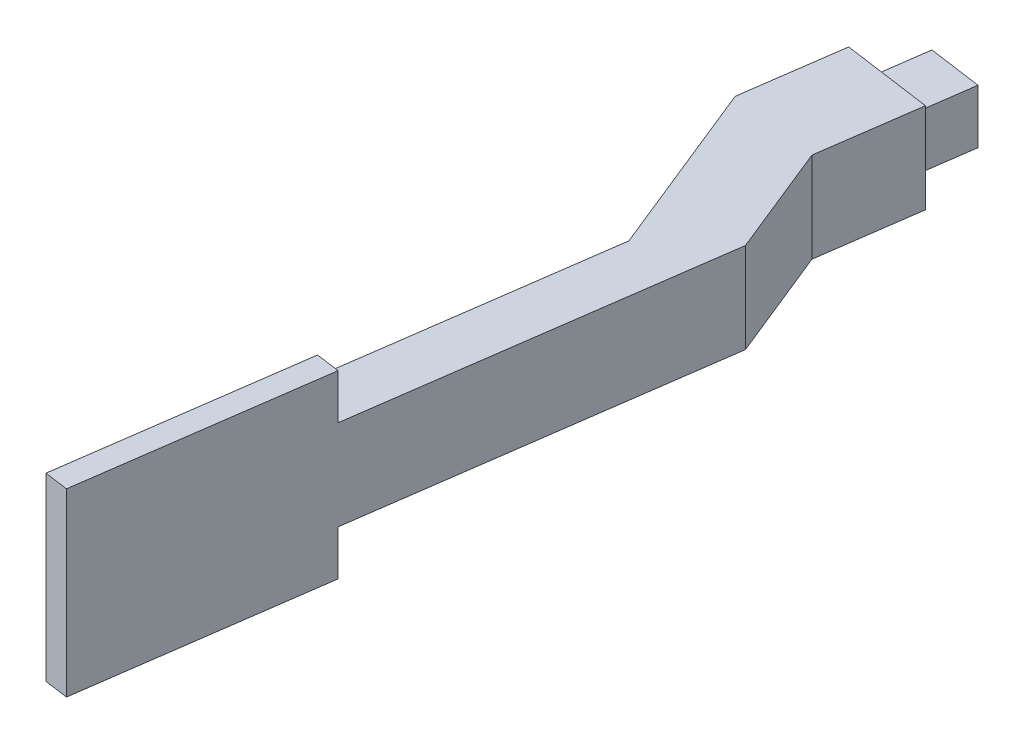
ISO-10303-21;
HEADER;
FILE_DESCRIPTION(('STEP AP214'),'2;1');
FILE_NAME('part.step','',(''),(''),'','','');
FILE_SCHEMA(('AUTOMOTIVE_DESIGN { 1 0 10303 214 1 1 1 1 }'));
ENDSEC;
DATA;
#1=APPLICATION_CONTEXT('core data for automotive mechanical design processes');
#2=APPLICATION_PROTOCOL_DEFINITION('international standard','automotive_design',2000,#1);
#3=PRODUCT_CONTEXT('',#1,'mechanical');
#4=PRODUCT('Part','Part','',(#3));
#5=PRODUCT_RELATED_PRODUCT_CATEGORY('part','',(#4));
#6=PRODUCT_DEFINITION_FORMATION('','',#4);
#7=PRODUCT_DEFINITION_CONTEXT('part definition',#1,'design');
#8=PRODUCT_DEFINITION('design','',#6,#7);
#9=PRODUCT_DEFINITION_SHAPE('','',#8);
#10=(LENGTH_UNIT() NAMED_UNIT(*) SI_UNIT(.MILLI.,.METRE.));
#11=(NAMED_UNIT(*) PLANE_ANGLE_UNIT() SI_UNIT($,.RADIAN.));
#12=(NAMED_UNIT(*) SI_UNIT($,.STERADIAN.) SOLID_ANGLE_UNIT());
#13=UNCERTAINTY_MEASURE_WITH_UNIT(LENGTH_MEASURE(1.E-05),#10,'distance_accuracy_value','');
#14=(GEOMETRIC_REPRESENTATION_CONTEXT(3) GLOBAL_UNCERTAINTY_ASSIGNED_CONTEXT((#13)) GLOBAL_UNIT_ASSIGNED_CONTEXT((#10,
#11,#12)) REPRESENTATION_CONTEXT('',''));
#15=CARTESIAN_POINT('',(0.,0.,0.));
#16=DIRECTION('',(0.,0.,1.));
#17=DIRECTION('',(1.,0.,0.));
#18=AXIS2_PLACEMENT_3D('',#15,#16,#17);
#19=CARTESIAN_POINT('',(-27.5433809510713,26.5609673847061,17.9798332960741));
#20=DIRECTION('',(-0.139173100960066,0.,0.99026806874157));
#21=DIRECTION('',(0.99026806874157,0.,0.139173100960066));
#22=AXIS2_PLACEMENT_3D('',#19,#20,#21);
#23=PLANE('',#22);
#24=DIRECTION('',(0.,-1.,0.));
#25=VECTOR('',#24,1.);
#26=CARTESIAN_POINT('',(-6.72495404474571,0.,20.9056723906798));
#27=LINE('',#26,#25);
#28=CARTESIAN_POINT('',(-6.72495404474571,5.,20.9056723906798));
#29=VERTEX_POINT('',#28);
#30=CARTESIAN_POINT('',(-6.72495404474571,-2.5,20.9056723906798));
#31=VERTEX_POINT('',#30);
#32=EDGE_CURVE('E348',#29,#31,#27,.T.);
#33=ORIENTED_EDGE('',*,*,#32,.F.);
#34=DIRECTION('',(0.99026806874157,0.,0.139173100960066));
#35=VECTOR('',#34,1.);
#36=CARTESIAN_POINT('',(-3.01144878696482,5.,21.4275715192801));
#37=LINE('',#36,#35);
#38=CARTESIAN_POINT('',(0.702056470816068,5.,21.9494706478803));
#39=VERTEX_POINT('',#38);
#40=EDGE_CURVE('E297',#29,#39,#37,.T.);
#41=ORIENTED_EDGE('',*,*,#40,.T.);
#42=DIRECTION('',(0.,-1.,0.));
#43=VECTOR('',#42,1.);
#44=CARTESIAN_POINT('',(0.702056470816068,-2.5,21.9494706478803));
#45=LINE('',#44,#43);
#46=CARTESIAN_POINT('',(0.702056470816069,-2.5,21.9494706478803));
#47=VERTEX_POINT('',#46);
#48=EDGE_CURVE('E294',#39,#47,#45,.T.);
#49=ORIENTED_EDGE('',*,*,#48,.T.);
#50=DIRECTION('',(-0.99026806874157,0.,-0.139173100960066));
#51=VECTOR('',#50,1.);
#52=CARTESIAN_POINT('',(-3.01144878696482,-2.5,21.4275715192801));
#53=LINE('',#52,#51);
#54=EDGE_CURVE('E361',#47,#31,#53,.T.);
#55=ORIENTED_EDGE('',*,*,#54,.T.);
#56=EDGE_LOOP('',(#33,#41,#49,#55));
#57=FACE_BOUND('',#56,.T.);
#58=DIRECTION('',(0.,-1.,0.));
#59=VECTOR('',#58,1.);
#60=CARTESIAN_POINT('',(-0.783345632296287,3.5,21.7407109964402));
#61=LINE('',#60,#59);
#62=CARTESIAN_POINT('',(-0.783345632296287,3.5,21.7407109964402));
#63=VERTEX_POINT('',#62);
#64=CARTESIAN_POINT('',(-0.783345632296288,-0.999999999999999,21.7407109964402));
#65=VERTEX_POINT('',#64);
#66=EDGE_CURVE('E249',#63,#65,#61,.T.);
#67=ORIENTED_EDGE('',*,*,#66,.F.);
#68=DIRECTION('',(0.99026806874157,0.,0.139173100960066));
#69=VECTOR('',#68,1.);
#70=CARTESIAN_POINT('',(-0.783345632296287,3.5,21.7407109964402));
#71=LINE('',#70,#69);
#72=CARTESIAN_POINT('',(-5.23955194163335,3.5,21.1144320421199));
#73=VERTEX_POINT('',#72);
#74=EDGE_CURVE('E255',#73,#63,#71,.T.);
#75=ORIENTED_EDGE('',*,*,#74,.F.);
#76=DIRECTION('',(0.,1.,0.));
#77=VECTOR('',#76,1.);
#78=CARTESIAN_POINT('',(-5.23955194163335,3.5,21.1144320421199));
#79=LINE('',#78,#77);
#80=CARTESIAN_POINT('',(-5.23955194163335,-0.999999999999999,21.1144320421199));
#81=VERTEX_POINT('',#80);
#82=EDGE_CURVE('E272',#81,#73,#79,.T.);
#83=ORIENTED_EDGE('',*,*,#82,.F.);
#84=DIRECTION('',(-0.99026806874157,0.,-0.139173100960066));
#85=VECTOR('',#84,1.);
#86=CARTESIAN_POINT('',(-0.783345632296288,-0.999999999999999,21.7407109964402));
#87=LINE('',#86,#85);
#88=EDGE_CURVE('E268',#65,#81,#87,.T.);
#89=ORIENTED_EDGE('',*,*,#88,.F.);
#90=EDGE_LOOP('',(#67,#75,#83,#89));
#91=FACE_BOUND('',#90,.T.);
#92=ADVANCED_FACE('F39',(#57,#91),#23,.F.);
#93=CARTESIAN_POINT('',(0.,5.,0.));
#94=DIRECTION('',(0.,1.,0.));
#95=DIRECTION('',(0.,0.,1.));
#96=AXIS2_PLACEMENT_3D('',#93,#94,#95);
#97=PLANE('',#96);
#98=DIRECTION('',(-0.139173100960066,0.,0.99026806874157));
#99=VECTOR('',#98,1.);
#100=CARTESIAN_POINT('',(-6.73875218460164,5.,78.4862235318577));
#101=LINE('',#100,#99);
#102=CARTESIAN_POINT('',(-1.89499279192829,5.,44.0210846067157));
#103=VERTEX_POINT('',#102);
#104=CARTESIAN_POINT('',(-6.50103071612955,5.,76.7947473927307));
#105=VERTEX_POINT('',#104);
#106=EDGE_CURVE('E331',#103,#105,#101,.T.);
#107=ORIENTED_EDGE('',*,*,#106,.T.);
#108=CARTESIAN_POINT('',(-4.52049457864641,5.,77.0730935946508));
#109=DIRECTION('',(0.,1.,0.));
#110=DIRECTION('',(0.,0.,1.));
#111=AXIS2_PLACEMENT_3D('',#108,#109,#110);
#112=CIRCLE('',#111,2.);
#113=CARTESIAN_POINT('',(-6.19000538892378,5.,78.1743354637999));
#114=VERTEX_POINT('',#113);
#115=EDGE_CURVE('E400',#105,#114,#112,.T.);
#116=ORIENTED_EDGE('',*,*,#115,.T.);
#117=DIRECTION('',(-0.139173100960065,0.,0.99026806874157));
#118=VECTOR('',#117,1.);
#119=CARTESIAN_POINT('',(-4.8518871406302,5.,68.653129394922));
#120=LINE('',#119,#118);
#121=CARTESIAN_POINT('',(-4.8518871406302,5.,68.653129394922));
#122=VERTEX_POINT('',#121);
#123=EDGE_CURVE('E381',#114,#122,#120,.F.);
#124=ORIENTED_EDGE('',*,*,#123,.T.);
#125=DIRECTION('',(-0.99026806874157,0.,-0.139173100960065));
#126=VECTOR('',#125,1.);
#127=CARTESIAN_POINT('',(-9.55566046715264,5.,67.9920571653617));
#128=LINE('',#127,#126);
#129=CARTESIAN_POINT('',(-0.890814865663921,5.,69.2098217987623));
#130=VERTEX_POINT('',#129);
#131=EDGE_CURVE('E241',#130,#122,#128,.T.);
#132=ORIENTED_EDGE('',*,*,#131,.F.);
#133=DIRECTION('',(0.139173100960065,0.,-0.99026806874157));
#134=VECTOR('',#133,1.);
#135=CARTESIAN_POINT('',(3.28437816313803,5.,39.5017797365152));
#136=LINE('',#135,#134);
#137=CARTESIAN_POINT('',(3.28437816313803,5.,39.5017797365152));
#138=VERTEX_POINT('',#137);
#139=EDGE_CURVE('E335',#130,#138,#136,.T.);
#140=ORIENTED_EDGE('',*,*,#139,.T.);
#141=DIRECTION('',(-0.374606593415913,0.,-0.927183854566787));
#142=VECTOR('',#141,1.);
#143=CARTESIAN_POINT('',(-0.461687771021086,5.,30.2299411908474));
#144=LINE('',#143,#142);
#145=CARTESIAN_POINT('',(-0.461687771021086,5.,30.2299411908474));
#146=VERTEX_POINT('',#145);
#147=EDGE_CURVE('E338',#138,#146,#144,.T.);
#148=ORIENTED_EDGE('',*,*,#147,.T.);
#149=DIRECTION('',(0.139173100960066,0.,-0.99026806874157));
#150=VECTOR('',#149,1.);
#151=CARTESIAN_POINT('',(1.6259087433799,5.,15.3759201597238));
#152=LINE('',#151,#150);
#153=EDGE_CURVE('E305',#146,#39,#152,.T.);
#154=ORIENTED_EDGE('',*,*,#153,.T.);
#155=ORIENTED_EDGE('',*,*,#40,.F.);
#156=DIRECTION('',(-0.139173100960066,0.,0.99026806874157));
#157=VECTOR('',#156,1.);
#158=CARTESIAN_POINT('',(-5.80110177218188,5.,14.3321219025233));
#159=LINE('',#158,#157);
#160=CARTESIAN_POINT('',(-7.88869828658286,5.,29.1861429336469));
#161=VERTEX_POINT('',#160);
#162=EDGE_CURVE('E300',#29,#161,#159,.T.);
#163=ORIENTED_EDGE('',*,*,#162,.T.);
#164=DIRECTION('',(0.374606593415907,0.,0.927183854566789));
#165=VECTOR('',#164,1.);
#166=CARTESIAN_POINT('',(-1.89499279192829,5.,44.0210846067157));
#167=LINE('',#166,#165);
#168=EDGE_CURVE('E327',#161,#103,#167,.T.);
#169=ORIENTED_EDGE('',*,*,#168,.T.);
#170=EDGE_LOOP('',(#107,#116,#124,#132,#140,#148,#154,#155,#163,#169));
#171=FACE_BOUND('',#170,.T.);
#172=ADVANCED_FACE('F428',(#171),#97,.T.);
#173=CARTESIAN_POINT('',(-5.80110177218188,-2.5,14.3321219025233));
#174=DIRECTION('',(-0.99026806874157,0.,-0.139173100960066));
#175=DIRECTION('',(-0.139173100960066,0.,0.99026806874157));
#176=AXIS2_PLACEMENT_3D('',#173,#174,#175);
#177=PLANE('',#176);
#178=ORIENTED_EDGE('',*,*,#32,.T.);
#179=DIRECTION('',(-0.139173100960066,0.,0.99026806874157));
#180=VECTOR('',#179,1.);
#181=CARTESIAN_POINT('',(-5.80110177218188,-2.5,14.3321219025233));
#182=LINE('',#181,#180);
#183=CARTESIAN_POINT('',(-7.88869828658286,-2.5,29.1861429336469));
#184=VERTEX_POINT('',#183);
#185=EDGE_CURVE('E301',#31,#184,#182,.T.);
#186=ORIENTED_EDGE('',*,*,#185,.T.);
#187=DIRECTION('',(0.,1.,0.));
#188=VECTOR('',#187,1.);
#189=CARTESIAN_POINT('',(-7.88869828658286,-2.5,29.1861429336469));
#190=LINE('',#189,#188);
#191=EDGE_CURVE('E324',#184,#161,#190,.T.);
#192=ORIENTED_EDGE('',*,*,#191,.T.);
#193=ORIENTED_EDGE('',*,*,#162,.F.);
#194=EDGE_LOOP('',(#178,#186,#192,#193));
#195=FACE_BOUND('',#194,.T.);
#196=ADVANCED_FACE('F431',(#195),#177,.T.);
#197=CARTESIAN_POINT('',(1.6259087433799,-2.5,15.3759201597238));
#198=DIRECTION('',(0.99026806874157,0.,0.139173100960066));
#199=DIRECTION('',(0.139173100960066,0.,-0.99026806874157));
#200=AXIS2_PLACEMENT_3D('',#197,#198,#199);
#201=PLANE('',#200);
#202=ORIENTED_EDGE('',*,*,#48,.F.);
#203=ORIENTED_EDGE('',*,*,#153,.F.);
#204=DIRECTION('',(0.,1.,0.));
#205=VECTOR('',#204,1.);
#206=CARTESIAN_POINT('',(-0.461687771021086,-2.5,30.2299411908474));
#207=LINE('',#206,#205);
#208=CARTESIAN_POINT('',(-0.461687771021086,-2.5,30.2299411908474));
#209=VERTEX_POINT('',#208);
#210=EDGE_CURVE('E345',#209,#146,#207,.T.);
#211=ORIENTED_EDGE('',*,*,#210,.F.);
#212=DIRECTION('',(0.139173100960066,0.,-0.99026806874157));
#213=VECTOR('',#212,1.);
#214=CARTESIAN_POINT('',(1.6259087433799,-2.5,15.3759201597238));
#215=LINE('',#214,#213);
#216=EDGE_CURVE('E320',#209,#47,#215,.T.);
#217=ORIENTED_EDGE('',*,*,#216,.T.);
#218=EDGE_LOOP('',(#202,#203,#211,#217));
#219=FACE_BOUND('',#218,.T.);
#220=ADVANCED_FACE('F435',(#219),#201,.T.);
#221=CARTESIAN_POINT('',(-0.461687771021086,-2.5,30.2299411908474));
#222=DIRECTION('',(0.927183854566787,0.,-0.374606593415913));
#223=DIRECTION('',(-0.374606593415913,0.,-0.927183854566787));
#224=AXIS2_PLACEMENT_3D('',#221,#222,#223);
#225=PLANE('',#224);
#226=ORIENTED_EDGE('',*,*,#147,.F.);
#227=DIRECTION('',(0.,1.,0.));
#228=VECTOR('',#227,1.);
#229=CARTESIAN_POINT('',(3.28437816313803,-2.5,39.5017797365152));
#230=LINE('',#229,#228);
#231=CARTESIAN_POINT('',(3.28437816313803,-2.5,39.5017797365152));
#232=VERTEX_POINT('',#231);
#233=EDGE_CURVE('E349',#232,#138,#230,.T.);
#234=ORIENTED_EDGE('',*,*,#233,.F.);
#235=DIRECTION('',(-0.374606593415913,0.,-0.927183854566787));
#236=VECTOR('',#235,1.);
#237=CARTESIAN_POINT('',(-0.461687771021086,-2.5,30.2299411908474));
#238=LINE('',#237,#236);
#239=EDGE_CURVE('E316',#232,#209,#238,.T.);
#240=ORIENTED_EDGE('',*,*,#239,.T.);
#241=ORIENTED_EDGE('',*,*,#210,.T.);
#242=EDGE_LOOP('',(#226,#234,#240,#241));
#243=FACE_BOUND('',#242,.T.);
#244=ADVANCED_FACE('F449',(#243),#225,.T.);
#245=CARTESIAN_POINT('',(3.28437816313803,-2.5,39.5017797365152));
#246=DIRECTION('',(0.99026806874157,0.,0.139173100960065));
#247=DIRECTION('',(0.139173100960065,0.,-0.99026806874157));
#248=AXIS2_PLACEMENT_3D('',#245,#246,#247);
#249=PLANE('',#248);
#250=ORIENTED_EDGE('',*,*,#139,.F.);
#251=DIRECTION('',(0.,1.,0.));
#252=VECTOR('',#251,1.);
#253=CARTESIAN_POINT('',(-0.890814865663921,8.75,69.2098217987623));
#254=LINE('',#253,#252);
#255=CARTESIAN_POINT('',(-0.890814865663921,8.75,69.2098217987623));
#256=VERTEX_POINT('',#255);
#257=EDGE_CURVE('E228',#130,#256,#254,.T.);
#258=ORIENTED_EDGE('',*,*,#257,.T.);
#259=DIRECTION('',(-0.139173100960065,0.,0.99026806874157));
#260=VECTOR('',#259,1.);
#261=CARTESIAN_POINT('',(-0.890814865663921,8.75,69.2098217987623));
#262=LINE('',#261,#260);
#263=CARTESIAN_POINT('',(-3.67427688486523,8.75,89.0151831735937));
#264=VERTEX_POINT('',#263);
#265=EDGE_CURVE('E204',#256,#264,#262,.T.);
#266=ORIENTED_EDGE('',*,*,#265,.T.);
#267=DIRECTION('',(0.,-1.,0.));
#268=VECTOR('',#267,1.);
#269=CARTESIAN_POINT('',(-3.67427688486523,8.75,89.0151831735937));
#270=LINE('',#269,#268);
#271=CARTESIAN_POINT('',(-3.67427688486523,-6.25,89.0151831735937));
#272=VERTEX_POINT('',#271);
#273=EDGE_CURVE('E231',#264,#272,#270,.T.);
#274=ORIENTED_EDGE('',*,*,#273,.T.);
#275=DIRECTION('',(0.139173100960065,0.,-0.99026806874157));
#276=VECTOR('',#275,1.);
#277=CARTESIAN_POINT('',(-0.890814865663921,-6.25,69.2098217987623));
#278=LINE('',#277,#276);
#279=CARTESIAN_POINT('',(-0.890814865663921,-6.25,69.2098217987623));
#280=VERTEX_POINT('',#279);
#281=EDGE_CURVE('E197',#272,#280,#278,.T.);
#282=ORIENTED_EDGE('',*,*,#281,.T.);
#283=CARTESIAN_POINT('',(-0.890814865663917,-2.5,69.2098217987622));
#284=VERTEX_POINT('',#283);
#285=EDGE_CURVE('E225',#280,#284,#254,.T.);
#286=ORIENTED_EDGE('',*,*,#285,.T.);
#287=DIRECTION('',(0.139173100960065,0.,-0.99026806874157));
#288=VECTOR('',#287,1.);
#289=CARTESIAN_POINT('',(3.28437816313803,-2.5,39.5017797365152));
#290=LINE('',#289,#288);
#291=EDGE_CURVE('E313',#284,#232,#290,.T.);
#292=ORIENTED_EDGE('',*,*,#291,.T.);
#293=ORIENTED_EDGE('',*,*,#233,.T.);
#294=EDGE_LOOP('',(#250,#258,#266,#274,#282,#286,#292,#293));
#295=FACE_BOUND('',#294,.T.);
#296=ADVANCED_FACE('F445',(#295),#249,.T.);
#297=CARTESIAN_POINT('',(-6.73875218460164,-2.5,78.4862235318577));
#298=DIRECTION('',(-0.99026806874157,0.,-0.139173100960066));
#299=DIRECTION('',(-0.139173100960066,0.,0.99026806874157));
#300=AXIS2_PLACEMENT_3D('',#297,#298,#299);
#301=PLANE('',#300);
#302=DIRECTION('',(-0.139173100960066,0.,0.99026806874157));
#303=VECTOR('',#302,1.);
#304=CARTESIAN_POINT('',(-6.73875218460164,-2.5,78.4862235318577));
#305=LINE('',#304,#303);
#306=CARTESIAN_POINT('',(-1.89499279192829,-2.5,44.0210846067157));
#307=VERTEX_POINT('',#306);
#308=CARTESIAN_POINT('',(-6.50103071612955,-2.5,76.7947473927307));
#309=VERTEX_POINT('',#308);
#310=EDGE_CURVE('E309',#307,#309,#305,.T.);
#311=ORIENTED_EDGE('',*,*,#310,.T.);
#312=DIRECTION('',(0.,-1.,0.));
#313=VECTOR('',#312,1.);
#314=CARTESIAN_POINT('',(-6.50103071612955,5.,76.7947473927307));
#315=LINE('',#314,#313);
#316=EDGE_CURVE('E390',#309,#105,#315,.F.);
#317=ORIENTED_EDGE('',*,*,#316,.T.);
#318=ORIENTED_EDGE('',*,*,#106,.F.);
#319=DIRECTION('',(0.,1.,0.));
#320=VECTOR('',#319,1.);
#321=CARTESIAN_POINT('',(-1.89499279192829,-2.5,44.0210846067157));
#322=LINE('',#321,#320);
#323=EDGE_CURVE('E353',#307,#103,#322,.T.);
#324=ORIENTED_EDGE('',*,*,#323,.F.);
#325=EDGE_LOOP('',(#311,#317,#318,#324));
#326=FACE_BOUND('',#325,.T.);
#327=ADVANCED_FACE('F441',(#326),#301,.T.);
#328=CARTESIAN_POINT('',(-1.89499279192829,-2.5,44.0210846067157));
#329=DIRECTION('',(-0.927183854566789,0.,0.374606593415907));
#330=DIRECTION('',(0.374606593415907,0.,0.92718385456679));
#331=AXIS2_PLACEMENT_3D('',#328,#329,#330);
#332=PLANE('',#331);
#333=ORIENTED_EDGE('',*,*,#168,.F.);
#334=ORIENTED_EDGE('',*,*,#191,.F.);
#335=DIRECTION('',(0.374606593415907,0.,0.927183854566789));
#336=VECTOR('',#335,1.);
#337=CARTESIAN_POINT('',(-1.89499279192829,-2.5,44.0210846067157));
#338=LINE('',#337,#336);
#339=EDGE_CURVE('E304',#184,#307,#338,.T.);
#340=ORIENTED_EDGE('',*,*,#339,.T.);
#341=ORIENTED_EDGE('',*,*,#323,.T.);
#342=EDGE_LOOP('',(#333,#334,#340,#341));
#343=FACE_BOUND('',#342,.T.);
#344=ADVANCED_FACE('F437',(#343),#332,.T.);
#345=CARTESIAN_POINT('',(0.,-2.5,0.));
#346=DIRECTION('',(0.,-1.,0.));
#347=DIRECTION('',(0.,0.,-1.));
#348=AXIS2_PLACEMENT_3D('',#345,#346,#347);
#349=PLANE('',#348);
#350=DIRECTION('',(0.139173100960065,0.,-0.99026806874157));
#351=VECTOR('',#350,1.);
#352=CARTESIAN_POINT('',(-6.24361815023086,-2.5,78.5558100823378));
#353=LINE('',#352,#351);
#354=CARTESIAN_POINT('',(-4.85188714063021,-2.5,68.653129394922));
#355=VERTEX_POINT('',#354);
#356=CARTESIAN_POINT('',(-6.19000538892378,-2.5,78.1743354637999));
#357=VERTEX_POINT('',#356);
#358=EDGE_CURVE('E378',#355,#357,#353,.F.);
#359=ORIENTED_EDGE('',*,*,#358,.T.);
#360=CARTESIAN_POINT('',(-4.52049457864641,-2.5,77.0730935946508));
#361=DIRECTION('',(0.,-1.,0.));
#362=DIRECTION('',(0.,0.,-1.));
#363=AXIS2_PLACEMENT_3D('',#360,#361,#362);
#364=CIRCLE('',#363,2.);
#365=EDGE_CURVE('E11',#357,#309,#364,.T.);
#366=ORIENTED_EDGE('',*,*,#365,.T.);
#367=ORIENTED_EDGE('',*,*,#310,.F.);
#368=ORIENTED_EDGE('',*,*,#339,.F.);
#369=ORIENTED_EDGE('',*,*,#185,.F.);
#370=ORIENTED_EDGE('',*,*,#54,.F.);
#371=ORIENTED_EDGE('',*,*,#216,.F.);
#372=ORIENTED_EDGE('',*,*,#239,.F.);
#373=ORIENTED_EDGE('',*,*,#291,.F.);
#374=DIRECTION('',(0.99026806874157,0.,0.139173100960065));
#375=VECTOR('',#374,1.);
#376=CARTESIAN_POINT('',(-9.55566046715264,-2.5,67.9920571653617));
#377=LINE('',#376,#375);
#378=EDGE_CURVE('E365',#355,#284,#377,.T.);
#379=ORIENTED_EDGE('',*,*,#378,.F.);
#380=EDGE_LOOP('',(#359,#366,#367,#368,#369,#370,#371,#372,#373,#379));
#381=FACE_BOUND('',#380,.T.);
#382=ADVANCED_FACE('F440',(#381),#349,.T.);
#383=CARTESIAN_POINT('',(-0.0874801274959586,3.5,16.7893706527324));
#384=DIRECTION('',(-0.99026806874157,0.,-0.139173100960066));
#385=DIRECTION('',(-0.139173100960066,0.,0.99026806874157));
#386=AXIS2_PLACEMENT_3D('',#383,#384,#385);
#387=PLANE('',#386);
#388=ORIENTED_EDGE('',*,*,#66,.T.);
#389=DIRECTION('',(-0.139173100960066,0.,0.99026806874157));
#390=VECTOR('',#389,1.);
#391=CARTESIAN_POINT('',(-0.087480127495959,-0.999999999999999,16.7893706527324));
#392=LINE('',#391,#390);
#393=CARTESIAN_POINT('',(-0.087480127495959,-0.999999999999999,16.7893706527324));
#394=VERTEX_POINT('',#393);
#395=EDGE_CURVE('E290',#394,#65,#392,.T.);
#396=ORIENTED_EDGE('',*,*,#395,.F.);
#397=DIRECTION('',(0.,-1.,0.));
#398=VECTOR('',#397,1.);
#399=CARTESIAN_POINT('',(-0.0874801274959586,3.5,16.7893706527324));
#400=LINE('',#399,#398);
#401=CARTESIAN_POINT('',(-0.0874801274959586,3.5,16.7893706527324));
#402=VERTEX_POINT('',#401);
#403=EDGE_CURVE('E250',#402,#394,#400,.T.);
#404=ORIENTED_EDGE('',*,*,#403,.F.);
#405=DIRECTION('',(-0.139173100960066,0.,0.99026806874157));
#406=VECTOR('',#405,1.);
#407=CARTESIAN_POINT('',(-0.0874801274959586,3.5,16.7893706527324));
#408=LINE('',#407,#406);
#409=EDGE_CURVE('E264',#402,#63,#408,.T.);
#410=ORIENTED_EDGE('',*,*,#409,.T.);
#411=EDGE_LOOP('',(#388,#396,#404,#410));
#412=FACE_BOUND('',#411,.T.);
#413=ADVANCED_FACE('F459',(#412),#387,.F.);
#414=CARTESIAN_POINT('',(-0.087480127495959,-0.999999999999999,16.7893706527324));
#415=DIRECTION('',(0.,1.,0.));
#416=DIRECTION('',(0.,0.,1.));
#417=AXIS2_PLACEMENT_3D('',#414,#415,#416);
#418=PLANE('',#417);
#419=ORIENTED_EDGE('',*,*,#88,.T.);
#420=DIRECTION('',(-0.139173100960066,0.,0.99026806874157));
#421=VECTOR('',#420,1.);
#422=CARTESIAN_POINT('',(-4.54368643683303,-0.999999999999999,16.1630916984121));
#423=LINE('',#422,#421);
#424=CARTESIAN_POINT('',(-4.54368643683303,-0.999999999999999,16.1630916984121));
#425=VERTEX_POINT('',#424);
#426=EDGE_CURVE('E286',#425,#81,#423,.T.);
#427=ORIENTED_EDGE('',*,*,#426,.F.);
#428=DIRECTION('',(-0.99026806874157,0.,-0.139173100960066));
#429=VECTOR('',#428,1.);
#430=CARTESIAN_POINT('',(-0.087480127495959,-0.999999999999999,16.7893706527324));
#431=LINE('',#430,#429);
#432=EDGE_CURVE('E254',#394,#425,#431,.T.);
#433=ORIENTED_EDGE('',*,*,#432,.F.);
#434=ORIENTED_EDGE('',*,*,#395,.T.);
#435=EDGE_LOOP('',(#419,#427,#433,#434));
#436=FACE_BOUND('',#435,.T.);
#437=ADVANCED_FACE('F466',(#436),#418,.F.);
#438=CARTESIAN_POINT('',(-4.54368643683302,3.5,16.1630916984121));
#439=DIRECTION('',(0.99026806874157,0.,0.139173100960066));
#440=DIRECTION('',(0.139173100960066,0.,-0.99026806874157));
#441=AXIS2_PLACEMENT_3D('',#438,#439,#440);
#442=PLANE('',#441);
#443=ORIENTED_EDGE('',*,*,#82,.T.);
#444=DIRECTION('',(-0.139173100960066,0.,0.99026806874157));
#445=VECTOR('',#444,1.);
#446=CARTESIAN_POINT('',(-4.54368643683302,3.5,16.1630916984121));
#447=LINE('',#446,#445);
#448=CARTESIAN_POINT('',(-4.54368643683302,3.5,16.1630916984121));
#449=VERTEX_POINT('',#448);
#450=EDGE_CURVE('E282',#449,#73,#447,.T.);
#451=ORIENTED_EDGE('',*,*,#450,.F.);
#452=DIRECTION('',(0.,1.,0.));
#453=VECTOR('',#452,1.);
#454=CARTESIAN_POINT('',(-4.54368643683302,3.5,16.1630916984121));
#455=LINE('',#454,#453);
#456=EDGE_CURVE('E258',#425,#449,#455,.T.);
#457=ORIENTED_EDGE('',*,*,#456,.F.);
#458=ORIENTED_EDGE('',*,*,#426,.T.);
#459=EDGE_LOOP('',(#443,#451,#457,#458));
#460=FACE_BOUND('',#459,.T.);
#461=ADVANCED_FACE('F470',(#460),#442,.F.);
#462=CARTESIAN_POINT('',(-0.0874801274959586,3.5,16.7893706527324));
#463=DIRECTION('',(0.,-1.,0.));
#464=DIRECTION('',(0.,0.,-1.));
#465=AXIS2_PLACEMENT_3D('',#462,#463,#464);
#466=PLANE('',#465);
#467=ORIENTED_EDGE('',*,*,#74,.T.);
#468=ORIENTED_EDGE('',*,*,#409,.F.);
#469=DIRECTION('',(0.99026806874157,0.,0.139173100960066));
#470=VECTOR('',#469,1.);
#471=CARTESIAN_POINT('',(-0.0874801274959586,3.5,16.7893706527324));
#472=LINE('',#471,#470);
#473=EDGE_CURVE('E261',#449,#402,#472,.T.);
#474=ORIENTED_EDGE('',*,*,#473,.F.);
#475=ORIENTED_EDGE('',*,*,#450,.T.);
#476=EDGE_LOOP('',(#467,#468,#474,#475));
#477=FACE_BOUND('',#476,.T.);
#478=ADVANCED_FACE('F474',(#477),#466,.F.);
#479=CARTESIAN_POINT('',(-2.3155832821645,0.,16.4762311755722));
#480=DIRECTION('',(0.139173100960066,0.,-0.99026806874157));
#481=DIRECTION('',(-0.99026806874157,0.,-0.139173100960066));
#482=AXIS2_PLACEMENT_3D('',#479,#480,#481);
#483=PLANE('',#482);
#484=ORIENTED_EDGE('',*,*,#403,.T.);
#485=ORIENTED_EDGE('',*,*,#432,.T.);
#486=ORIENTED_EDGE('',*,*,#456,.T.);
#487=ORIENTED_EDGE('',*,*,#473,.T.);
#488=EDGE_LOOP('',(#484,#485,#486,#487));
#489=FACE_BOUND('',#488,.T.);
#490=ADVANCED_FACE('F478',(#489),#483,.T.);
#491=CARTESIAN_POINT('',(-2.87135100314706,8.75,68.9314755968421));
#492=DIRECTION('',(0.139173100960065,0.,-0.99026806874157));
#493=DIRECTION('',(-0.99026806874157,0.,-0.139173100960065));
#494=AXIS2_PLACEMENT_3D('',#491,#492,#493);
#495=PLANE('',#494);
#496=ORIENTED_EDGE('',*,*,#257,.F.);
#497=ORIENTED_EDGE('',*,*,#131,.T.);
#498=CARTESIAN_POINT('',(-4.8518871406302,7.,68.653129394922));
#499=DIRECTION('',(0.139173100960065,0.,-0.99026806874157));
#500=DIRECTION('',(-0.99026806874157,0.,-0.139173100960065));
#501=AXIS2_PLACEMENT_3D('',#498,#499,#500);
#502=CIRCLE('',#501,2.);
#503=CARTESIAN_POINT('',(-2.87135100314706,7.,68.9314755968421));
#504=VERTEX_POINT('',#503);
#505=EDGE_CURVE('E191',#122,#504,#502,.F.);
#506=ORIENTED_EDGE('',*,*,#505,.T.);
#507=DIRECTION('',(0.,1.,0.));
#508=VECTOR('',#507,1.);
#509=CARTESIAN_POINT('',(-2.87135100314706,8.75,68.9314755968421));
#510=LINE('',#509,#508);
#511=CARTESIAN_POINT('',(-2.87135100314706,8.75,68.9314755968421));
#512=VERTEX_POINT('',#511);
#513=EDGE_CURVE('E184',#504,#512,#510,.T.);
#514=ORIENTED_EDGE('',*,*,#513,.T.);
#515=DIRECTION('',(0.99026806874157,0.,0.139173100960065));
#516=VECTOR('',#515,1.);
#517=CARTESIAN_POINT('',(-2.87135100314706,8.75,68.9314755968421));
#518=LINE('',#517,#516);
#519=EDGE_CURVE('E187',#512,#256,#518,.T.);
#520=ORIENTED_EDGE('',*,*,#519,.T.);
#521=EDGE_LOOP('',(#496,#497,#506,#514,#520));
#522=FACE_BOUND('',#521,.T.);
#523=ADVANCED_FACE('F186',(#522),#495,.T.);
#524=CARTESIAN_POINT('',(-2.87135100314706,-6.25,68.9314755968421));
#525=VERTEX_POINT('',#524);
#526=CARTESIAN_POINT('',(-2.87135100314706,-4.5,68.9314755968421));
#527=VERTEX_POINT('',#526);
#528=EDGE_CURVE('E196',#525,#527,#510,.T.);
#529=ORIENTED_EDGE('',*,*,#528,.T.);
#530=CARTESIAN_POINT('',(-4.8518871406302,-4.5,68.653129394922));
#531=DIRECTION('',(0.139173100960065,0.,-0.99026806874157));
#532=DIRECTION('',(-0.99026806874157,0.,-0.139173100960065));
#533=AXIS2_PLACEMENT_3D('',#530,#531,#532);
#534=CIRCLE('',#533,2.);
#535=EDGE_CURVE('E384',#527,#355,#534,.F.);
#536=ORIENTED_EDGE('',*,*,#535,.T.);
#537=ORIENTED_EDGE('',*,*,#378,.T.);
#538=ORIENTED_EDGE('',*,*,#285,.F.);
#539=DIRECTION('',(0.99026806874157,0.,0.139173100960065));
#540=VECTOR('',#539,1.);
#541=CARTESIAN_POINT('',(-2.87135100314706,-6.25,68.9314755968421));
#542=LINE('',#541,#540);
#543=EDGE_CURVE('E238',#525,#280,#542,.T.);
#544=ORIENTED_EDGE('',*,*,#543,.F.);
#545=EDGE_LOOP('',(#529,#536,#537,#538,#544));
#546=FACE_BOUND('',#545,.T.);
#547=ADVANCED_FACE('F483',(#546),#495,.T.);
#548=CARTESIAN_POINT('',(-2.87135100314706,-6.25,68.9314755968421));
#549=DIRECTION('',(0.,-1.,0.));
#550=DIRECTION('',(0.,0.,-1.));
#551=AXIS2_PLACEMENT_3D('',#548,#549,#550);
#552=PLANE('',#551);
#553=ORIENTED_EDGE('',*,*,#281,.F.);
#554=DIRECTION('',(0.99026806874157,0.,0.139173100960065));
#555=VECTOR('',#554,1.);
#556=CARTESIAN_POINT('',(-5.65481302234837,-6.25,88.7368369716736));
#557=LINE('',#556,#555);
#558=CARTESIAN_POINT('',(-5.65481302234837,-6.25,88.7368369716736));
#559=VERTEX_POINT('',#558);
#560=EDGE_CURVE('E242',#559,#272,#557,.T.);
#561=ORIENTED_EDGE('',*,*,#560,.F.);
#562=DIRECTION('',(0.139173100960065,0.,-0.99026806874157));
#563=VECTOR('',#562,1.);
#564=CARTESIAN_POINT('',(-2.87135100314706,-6.25,68.9314755968421));
#565=LINE('',#564,#563);
#566=EDGE_CURVE('E207',#559,#525,#565,.T.);
#567=ORIENTED_EDGE('',*,*,#566,.T.);
#568=ORIENTED_EDGE('',*,*,#543,.T.);
#569=EDGE_LOOP('',(#553,#561,#567,#568));
#570=FACE_BOUND('',#569,.T.);
#571=ADVANCED_FACE('F486',(#570),#552,.T.);
#572=CARTESIAN_POINT('',(-5.65481302234837,8.75,88.7368369716736));
#573=DIRECTION('',(-0.139173100960065,0.,0.99026806874157));
#574=DIRECTION('',(0.99026806874157,0.,0.139173100960065));
#575=AXIS2_PLACEMENT_3D('',#572,#573,#574);
#576=PLANE('',#575);
#577=ORIENTED_EDGE('',*,*,#273,.F.);
#578=DIRECTION('',(0.99026806874157,0.,0.139173100960065));
#579=VECTOR('',#578,1.);
#580=CARTESIAN_POINT('',(-5.65481302234837,8.75,88.7368369716736));
#581=LINE('',#580,#579);
#582=CARTESIAN_POINT('',(-5.65481302234837,8.75,88.7368369716736));
#583=VERTEX_POINT('',#582);
#584=EDGE_CURVE('E206',#583,#264,#581,.T.);
#585=ORIENTED_EDGE('',*,*,#584,.F.);
#586=DIRECTION('',(0.,-1.,0.));
#587=VECTOR('',#586,1.);
#588=CARTESIAN_POINT('',(-5.65481302234837,8.75,88.7368369716736));
#589=LINE('',#588,#587);
#590=EDGE_CURVE('E214',#583,#559,#589,.T.);
#591=ORIENTED_EDGE('',*,*,#590,.T.);
#592=ORIENTED_EDGE('',*,*,#560,.T.);
#593=EDGE_LOOP('',(#577,#585,#591,#592));
#594=FACE_BOUND('',#593,.T.);
#595=ADVANCED_FACE('F490',(#594),#576,.T.);
#596=CARTESIAN_POINT('',(-2.87135100314706,8.75,68.9314755968421));
#597=DIRECTION('',(0.,1.,0.));
#598=DIRECTION('',(0.,0.,1.));
#599=AXIS2_PLACEMENT_3D('',#596,#597,#598);
#600=PLANE('',#599);
#601=ORIENTED_EDGE('',*,*,#265,.F.);
#602=ORIENTED_EDGE('',*,*,#519,.F.);
#603=DIRECTION('',(-0.139173100960065,0.,0.99026806874157));
#604=VECTOR('',#603,1.);
#605=CARTESIAN_POINT('',(-2.87135100314706,8.75,68.9314755968421));
#606=LINE('',#605,#604);
#607=EDGE_CURVE('E202',#512,#583,#606,.T.);
#608=ORIENTED_EDGE('',*,*,#607,.T.);
#609=ORIENTED_EDGE('',*,*,#584,.T.);
#610=EDGE_LOOP('',(#601,#602,#608,#609));
#611=FACE_BOUND('',#610,.T.);
#612=ADVANCED_FACE('F201',(#611),#600,.T.);
#613=CARTESIAN_POINT('',(6.68430946400557,0.,0.939418431480436));
#614=DIRECTION('',(-0.99026806874157,0.,-0.139173100960065));
#615=DIRECTION('',(-0.139173100960065,0.,0.99026806874157));
#616=AXIS2_PLACEMENT_3D('',#613,#614,#615);
#617=PLANE('',#616);
#618=DIRECTION('',(0.,-1.,0.));
#619=VECTOR('',#618,1.);
#620=CARTESIAN_POINT('',(-4.54142821466785,-2.5,80.814692421741));
#621=LINE('',#620,#619);
#622=CARTESIAN_POINT('',(-4.54142821466785,7.,80.814692421741));
#623=VERTEX_POINT('',#622);
#624=CARTESIAN_POINT('',(-4.54142821466785,-4.5,80.814692421741));
#625=VERTEX_POINT('',#624);
#626=EDGE_CURVE('E372',#623,#625,#621,.T.);
#627=ORIENTED_EDGE('',*,*,#626,.T.);
#628=DIRECTION('',(0.139173100960065,0.,-0.99026806874157));
#629=VECTOR('',#628,1.);
#630=CARTESIAN_POINT('',(-2.87135100314706,-4.5,68.9314755968421));
#631=LINE('',#630,#629);
#632=EDGE_CURVE('E375',#625,#527,#631,.T.);
#633=ORIENTED_EDGE('',*,*,#632,.T.);
#634=ORIENTED_EDGE('',*,*,#528,.F.);
#635=ORIENTED_EDGE('',*,*,#566,.F.);
#636=ORIENTED_EDGE('',*,*,#590,.F.);
#637=ORIENTED_EDGE('',*,*,#607,.F.);
#638=ORIENTED_EDGE('',*,*,#513,.F.);
#639=DIRECTION('',(-0.139173100960065,0.,0.99026806874157));
#640=VECTOR('',#639,1.);
#641=CARTESIAN_POINT('',(-4.26308201274772,7.,78.8341562842579));
#642=LINE('',#641,#640);
#643=EDGE_CURVE('E369',#504,#623,#642,.T.);
#644=ORIENTED_EDGE('',*,*,#643,.T.);
#645=EDGE_LOOP('',(#627,#633,#634,#635,#636,#637,#638,#644));
#646=FACE_BOUND('',#645,.T.);
#647=ADVANCED_FACE('F211',(#646),#617,.T.);
#648=CARTESIAN_POINT('',(4.70377332652243,7.,0.661072229560306));
#649=DIRECTION('',(0.139173100960065,0.,-0.99026806874157));
#650=DIRECTION('',(-0.99026806874157,0.,-0.139173100960065));
#651=AXIS2_PLACEMENT_3D('',#648,#649,#650);
#652=CYLINDRICAL_SURFACE('',#651,2.);
#653=ORIENTED_EDGE('',*,*,#123,.F.);
#654=CARTESIAN_POINT('',(-6.19000538892378,5.,78.1743354637999));
#655=CARTESIAN_POINT('',(-6.16451689487308,4.99999892517234,78.2129888520542));
#656=CARTESIAN_POINT('',(-6.13766884256625,5.00070331127659,78.2507592117707));
#657=CARTESIAN_POINT('',(-6.08143453049953,5.00385241507269,78.3243351435081));
#658=CARTESIAN_POINT('',(-6.0520460303416,5.00629868295905,78.3601389347798));
#659=CARTESIAN_POINT('',(-5.99171086904519,5.01317630077759,78.428658168313));
#660=CARTESIAN_POINT('',(-5.96082048053439,5.01755722723636,78.4614279862006));
#661=CARTESIAN_POINT('',(-5.89712797897149,5.0285655819234,78.5246078413381));
#662=CARTESIAN_POINT('',(-5.86432685823312,5.03519185252469,78.5550190846843));
#663=CARTESIAN_POINT('',(-5.78219404010549,5.05444509786984,78.6262274775508));
#664=CARTESIAN_POINT('',(-5.73197210333257,5.06842993932697,78.6656631980391));
#665=CARTESIAN_POINT('',(-5.65455465043212,5.09387944065645,78.7208015298987));
#666=CARTESIAN_POINT('',(-5.62815257329591,5.10321350379285,78.7386545375533));
#667=CARTESIAN_POINT('',(-5.57494978051289,5.12341844409758,78.7728359851302));
#668=CARTESIAN_POINT('',(-5.54814903621313,5.13428943220978,78.7891643148513));
#669=CARTESIAN_POINT('',(-5.5212294653987,5.14595037822609,78.8047199072358));
#670=B_SPLINE_CURVE_WITH_KNOTS('',3,(#654,#655,#656,#657,#658,#659,#660,#661,#662,#663,#664,
#665,#666,#667,#668,#669),.UNSPECIFIED.,.F.,.F.,(4,2,2,2,2,2,2,4),(0.,0.138885391472518,
0.277894539273326,0.413476795128808,0.54898925523556,0.744486314870554,0.844054904935257,
0.943630686091342),.UNSPECIFIED.);
#671=CARTESIAN_POINT('',(-5.5212294653987,5.14595037822609,78.8047199072358));
#672=VERTEX_POINT('',#671);
#673=EDGE_CURVE('E403',#114,#672,#670,.T.);
#674=ORIENTED_EDGE('',*,*,#673,.T.);
#675=CARTESIAN_POINT('',(-6.52196435215099,7.,80.5363462198209));
#676=DIRECTION('',(0.0984102434476221,0.707106781186547,-0.700225266599671));
#677=DIRECTION('',(0.0984102434476221,-0.707106781186547,-0.700225266599671));
#678=AXIS2_PLACEMENT_3D('',#675,#676,#677);
#679=ELLIPSE('',#678,2.82842712474619,2.);
#680=EDGE_CURVE('E394',#623,#672,#679,.T.);
#681=ORIENTED_EDGE('',*,*,#680,.F.);
#682=ORIENTED_EDGE('',*,*,#643,.F.);
#683=ORIENTED_EDGE('',*,*,#505,.F.);
#684=EDGE_LOOP('',(#653,#674,#681,#682,#683));
#685=FACE_BOUND('',#684,.T.);
#686=ADVANCED_FACE('F410',(#685),#652,.F.);
#687=CARTESIAN_POINT('',(4.70377332652243,-4.5,0.661072229560306));
#688=DIRECTION('',(-0.139173100960065,0.,0.99026806874157));
#689=DIRECTION('',(0.99026806874157,0.,0.139173100960065));
#690=AXIS2_PLACEMENT_3D('',#687,#688,#689);
#691=CYLINDRICAL_SURFACE('',#690,2.);
#692=CARTESIAN_POINT('',(-6.52196435215099,-4.5,80.5363462198209));
#693=DIRECTION('',(-0.0984102434476221,0.707106781186547,0.700225266599671));
#694=DIRECTION('',(-0.0984102434476221,-0.707106781186547,0.700225266599671));
#695=AXIS2_PLACEMENT_3D('',#692,#693,#694);
#696=ELLIPSE('',#695,2.82842712474619,2.);
#697=CARTESIAN_POINT('',(-5.5212294653987,-2.64595037822609,78.8047199072358));
#698=VERTEX_POINT('',#697);
#699=EDGE_CURVE('E391',#698,#625,#696,.F.);
#700=ORIENTED_EDGE('',*,*,#699,.F.);
#701=CARTESIAN_POINT('',(-5.5212294653987,-2.64595037822609,78.8047199072358));
#702=CARTESIAN_POINT('',(-5.55873328221359,-2.62969570657063,78.7830614794519));
#703=CARTESIAN_POINT('',(-5.59601452752224,-2.61498564081968,78.7598761444046));
#704=CARTESIAN_POINT('',(-5.6696561240064,-2.58852102959213,78.7105842385163));
#705=CARTESIAN_POINT('',(-5.70601692984404,-2.5767649982649,78.6844791458725));
#706=CARTESIAN_POINT('',(-5.7765335310586,-2.55630444834869,78.6301113296847));
#707=CARTESIAN_POINT('',(-5.81072118092859,-2.54753411217147,78.6019145411173));
#708=CARTESIAN_POINT('',(-5.87743343565223,-2.53245619640357,78.5430248938402));
#709=CARTESIAN_POINT('',(-5.90995825789549,-2.52614829416763,78.5123323627772));
#710=CARTESIAN_POINT('',(-5.98718797672636,-2.513410011125,78.4343482665805));
#711=CARTESIAN_POINT('',(-6.03081460170412,-2.50819308932649,78.3857850018347));
#712=CARTESIAN_POINT('',(-6.11397563935361,-2.50144855538854,78.2835790662222));
#713=CARTESIAN_POINT('',(-6.1534239064871,-2.49998790977504,78.2298616770757));
#714=CARTESIAN_POINT('',(-6.19000538892378,-2.5,78.1743354637999));
#715=B_SPLINE_CURVE_WITH_KNOTS('',3,(#701,#702,#703,#704,#705,#706,#707,#708,#709,#710,#711,
#712,#713,#714),.UNSPECIFIED.,.F.,.F.,(4,2,2,2,2,2,4),(0.,0.13871300338989,0.277356095189605,
0.412707787238349,0.548041738607651,0.74406176721573,0.943552935859972),.UNSPECIFIED.);
#716=EDGE_CURVE('E49',#698,#357,#715,.T.);
#717=ORIENTED_EDGE('',*,*,#716,.T.);
#718=ORIENTED_EDGE('',*,*,#358,.F.);
#719=ORIENTED_EDGE('',*,*,#535,.F.);
#720=ORIENTED_EDGE('',*,*,#632,.F.);
#721=EDGE_LOOP('',(#700,#717,#718,#719,#720));
#722=FACE_BOUND('',#721,.T.);
#723=ADVANCED_FACE('F414',(#722),#691,.F.);
#724=CARTESIAN_POINT('',(-6.52196435215099,0.,80.5363462198209));
#725=DIRECTION('',(0.,1.,0.));
#726=DIRECTION('',(0.,0.,1.));
#727=AXIS2_PLACEMENT_3D('',#724,#725,#726);
#728=CYLINDRICAL_SURFACE('',#727,2.);
#729=ORIENTED_EDGE('',*,*,#680,.T.);
#730=DIRECTION('',(0.,1.,0.));
#731=VECTOR('',#730,1.);
#732=CARTESIAN_POINT('',(-5.5212294653987,0.,78.8047199072358));
#733=LINE('',#732,#731);
#734=EDGE_CURVE('E63',#672,#698,#733,.F.);
#735=ORIENTED_EDGE('',*,*,#734,.T.);
#736=ORIENTED_EDGE('',*,*,#699,.T.);
#737=ORIENTED_EDGE('',*,*,#626,.F.);
#738=EDGE_LOOP('',(#729,#735,#736,#737));
#739=FACE_BOUND('',#738,.T.);
#740=ADVANCED_FACE('F419',(#739),#728,.F.);
#741=CARTESIAN_POINT('',(-4.52049457864641,0.,77.0730935946508));
#742=DIRECTION('',(0.,1.,0.));
#743=DIRECTION('',(0.,0.,1.));
#744=AXIS2_PLACEMENT_3D('',#741,#742,#743);
#745=CYLINDRICAL_SURFACE('',#744,2.);
#746=ORIENTED_EDGE('',*,*,#716,.F.);
#747=ORIENTED_EDGE('',*,*,#734,.F.);
#748=ORIENTED_EDGE('',*,*,#673,.F.);
#749=ORIENTED_EDGE('',*,*,#115,.F.);
#750=ORIENTED_EDGE('',*,*,#316,.F.);
#751=ORIENTED_EDGE('',*,*,#365,.F.);
#752=EDGE_LOOP('',(#746,#747,#748,#749,#750,#751));
#753=FACE_BOUND('',#752,.T.);
#754=ADVANCED_FACE('F41',(#753),#745,.T.);
#755=CLOSED_SHELL('',(#92,#172,#196,#220,#244,#296,#327,#344,#382,#413,#437,#461,#478,#490,#523,
#547,#571,#595,#612,#647,#686,#723,#740,#754));
#756=MANIFOLD_SOLID_BREP('B2',#755);
#757=ADVANCED_BREP_SHAPE_REPRESENTATION('',(#18,#756),#14);
#758=SHAPE_DEFINITION_REPRESENTATION(#9,#757);
ENDSEC;
END-ISO-10303-21;
